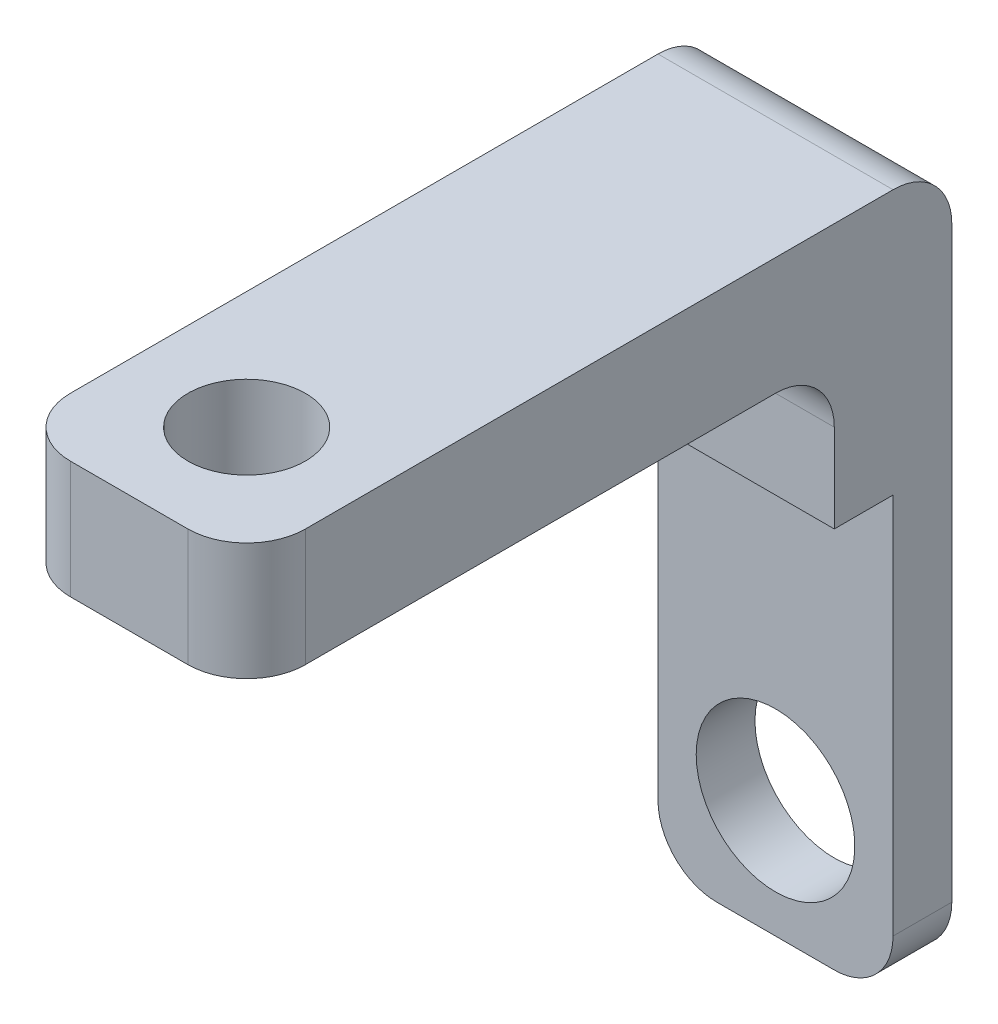
ISO-10303-21;
HEADER;
FILE_DESCRIPTION(('STEP AP214'),'2;1');
FILE_NAME('part.step','',(''),(''),'','','');
FILE_SCHEMA(('AUTOMOTIVE_DESIGN { 1 0 10303 214 1 1 1 1 }'));
ENDSEC;
DATA;
#1=APPLICATION_CONTEXT('core data for automotive mechanical design processes');
#2=APPLICATION_PROTOCOL_DEFINITION('international standard','automotive_design',2000,#1);
#3=PRODUCT_CONTEXT('',#1,'mechanical');
#4=PRODUCT('Part','Part','',(#3));
#5=PRODUCT_RELATED_PRODUCT_CATEGORY('part','',(#4));
#6=PRODUCT_DEFINITION_FORMATION('','',#4);
#7=PRODUCT_DEFINITION_CONTEXT('part definition',#1,'design');
#8=PRODUCT_DEFINITION('design','',#6,#7);
#9=PRODUCT_DEFINITION_SHAPE('','',#8);
#10=(LENGTH_UNIT() NAMED_UNIT(*) SI_UNIT(.MILLI.,.METRE.));
#11=(NAMED_UNIT(*) PLANE_ANGLE_UNIT() SI_UNIT($,.RADIAN.));
#12=(NAMED_UNIT(*) SI_UNIT($,.STERADIAN.) SOLID_ANGLE_UNIT());
#13=UNCERTAINTY_MEASURE_WITH_UNIT(LENGTH_MEASURE(1.E-05),#10,'distance_accuracy_value','');
#14=(GEOMETRIC_REPRESENTATION_CONTEXT(3) GLOBAL_UNCERTAINTY_ASSIGNED_CONTEXT((#13)) GLOBAL_UNIT_ASSIGNED_CONTEXT((#10,
#11,#12)) REPRESENTATION_CONTEXT('',''));
#15=CARTESIAN_POINT('',(0.,0.,0.));
#16=DIRECTION('',(0.,0.,1.));
#17=DIRECTION('',(1.,0.,0.));
#18=AXIS2_PLACEMENT_3D('',#15,#16,#17);
#19=CARTESIAN_POINT('',(0.,0.,0.));
#20=DIRECTION('',(0.,1.,0.));
#21=DIRECTION('',(0.,0.,1.));
#22=AXIS2_PLACEMENT_3D('',#19,#20,#21);
#23=PLANE('',#22);
#24=CARTESIAN_POINT('',(0.,0.,40.));
#25=DIRECTION('',(0.,1.,0.));
#26=DIRECTION('',(0.,0.,1.));
#27=AXIS2_PLACEMENT_3D('',#24,#25,#26);
#28=CIRCLE('',#27,10.);
#29=CARTESIAN_POINT('',(0.,0.,50.));
#30=VERTEX_POINT('',#29);
#31=EDGE_CURVE('E300',#30,#30,#28,.F.);
#32=ORIENTED_EDGE('',*,*,#31,.F.);
#33=EDGE_LOOP('',(#32));
#34=FACE_BOUND('',#33,.T.);
#35=DIRECTION('',(0.,0.,1.));
#36=VECTOR('',#35,1.);
#37=CARTESIAN_POINT('',(-20.,0.,-60.));
#38=LINE('',#37,#36);
#39=CARTESIAN_POINT('',(-20.,0.,-30.));
#40=VERTEX_POINT('',#39);
#41=CARTESIAN_POINT('',(-20.,0.,50.));
#42=VERTEX_POINT('',#41);
#43=EDGE_CURVE('E184',#40,#42,#38,.T.);
#44=ORIENTED_EDGE('',*,*,#43,.F.);
#45=DIRECTION('',(-1.,0.,0.));
#46=VECTOR('',#45,1.);
#47=CARTESIAN_POINT('',(20.,0.,-30.));
#48=LINE('',#47,#46);
#49=CARTESIAN_POINT('',(20.,0.,-30.));
#50=VERTEX_POINT('',#49);
#51=EDGE_CURVE('E53',#40,#50,#48,.F.);
#52=ORIENTED_EDGE('',*,*,#51,.T.);
#53=DIRECTION('',(0.,0.,-1.));
#54=VECTOR('',#53,1.);
#55=CARTESIAN_POINT('',(20.,0.,-60.));
#56=LINE('',#55,#54);
#57=CARTESIAN_POINT('',(20.,0.,50.));
#58=VERTEX_POINT('',#57);
#59=EDGE_CURVE('E181',#58,#50,#56,.T.);
#60=ORIENTED_EDGE('',*,*,#59,.F.);
#61=CARTESIAN_POINT('',(10.,0.,50.));
#62=DIRECTION('',(0.,1.,0.));
#63=DIRECTION('',(0.,0.,1.));
#64=AXIS2_PLACEMENT_3D('',#61,#62,#63);
#65=CIRCLE('',#64,10.);
#66=CARTESIAN_POINT('',(10.,0.,60.));
#67=VERTEX_POINT('',#66);
#68=EDGE_CURVE('E198',#58,#67,#65,.F.);
#69=ORIENTED_EDGE('',*,*,#68,.T.);
#70=DIRECTION('',(1.,0.,0.));
#71=VECTOR('',#70,1.);
#72=CARTESIAN_POINT('',(-20.,0.,60.));
#73=LINE('',#72,#71);
#74=CARTESIAN_POINT('',(-10.,0.,60.));
#75=VERTEX_POINT('',#74);
#76=EDGE_CURVE('E169',#75,#67,#73,.T.);
#77=ORIENTED_EDGE('',*,*,#76,.F.);
#78=CARTESIAN_POINT('',(-10.,0.,50.));
#79=DIRECTION('',(0.,1.,0.));
#80=DIRECTION('',(0.,0.,1.));
#81=AXIS2_PLACEMENT_3D('',#78,#79,#80);
#82=CIRCLE('',#81,10.);
#83=EDGE_CURVE('E195',#75,#42,#82,.F.);
#84=ORIENTED_EDGE('',*,*,#83,.T.);
#85=EDGE_LOOP('',(#44,#52,#60,#69,#77,#84));
#86=FACE_BOUND('',#85,.T.);
#87=ADVANCED_FACE('F32',(#34,#86),#23,.F.);
#88=CARTESIAN_POINT('',(20.,20.,-60.));
#89=DIRECTION('',(-1.,0.,0.));
#90=DIRECTION('',(0.,0.,1.));
#91=AXIS2_PLACEMENT_3D('',#88,#89,#90);
#92=PLANE('',#91);
#93=DIRECTION('',(0.,0.,-1.));
#94=VECTOR('',#93,1.);
#95=CARTESIAN_POINT('',(20.,20.,-60.));
#96=LINE('',#95,#94);
#97=CARTESIAN_POINT('',(20.,20.,50.));
#98=VERTEX_POINT('',#97);
#99=CARTESIAN_POINT('',(20.,20.,-50.));
#100=VERTEX_POINT('',#99);
#101=EDGE_CURVE('E165',#98,#100,#96,.T.);
#102=ORIENTED_EDGE('',*,*,#101,.F.);
#103=DIRECTION('',(0.,-1.,0.));
#104=VECTOR('',#103,1.);
#105=CARTESIAN_POINT('',(20.,20.,50.));
#106=LINE('',#105,#104);
#107=EDGE_CURVE('E192',#98,#58,#106,.T.);
#108=ORIENTED_EDGE('',*,*,#107,.T.);
#109=ORIENTED_EDGE('',*,*,#59,.T.);
#110=CARTESIAN_POINT('',(20.,-9.99999999999999,-30.));
#111=DIRECTION('',(-1.,0.,0.));
#112=DIRECTION('',(0.,0.,1.));
#113=AXIS2_PLACEMENT_3D('',#110,#111,#112);
#114=CIRCLE('',#113,10.);
#115=CARTESIAN_POINT('',(20.,-10.,-40.));
#116=VERTEX_POINT('',#115);
#117=EDGE_CURVE('E11',#50,#116,#114,.T.);
#118=ORIENTED_EDGE('',*,*,#117,.T.);
#119=DIRECTION('',(0.,1.,0.));
#120=VECTOR('',#119,1.);
#121=CARTESIAN_POINT('',(20.,-100.,-40.));
#122=LINE('',#121,#120);
#123=CARTESIAN_POINT('',(20.,-25.,-40.));
#124=VERTEX_POINT('',#123);
#125=EDGE_CURVE('E156',#124,#116,#122,.T.);
#126=ORIENTED_EDGE('',*,*,#125,.F.);
#127=DIRECTION('',(0.,0.,1.));
#128=VECTOR('',#127,1.);
#129=CARTESIAN_POINT('',(20.,-25.,-50.));
#130=LINE('',#129,#128);
#131=CARTESIAN_POINT('',(20.,-25.,-50.));
#132=VERTEX_POINT('',#131);
#133=EDGE_CURVE('E147',#132,#124,#130,.T.);
#134=ORIENTED_EDGE('',*,*,#133,.F.);
#135=DIRECTION('',(0.,1.,0.));
#136=VECTOR('',#135,1.);
#137=CARTESIAN_POINT('',(20.,-100.,-50.));
#138=LINE('',#137,#136);
#139=CARTESIAN_POINT('',(20.,-90.,-50.));
#140=VERTEX_POINT('',#139);
#141=EDGE_CURVE('E132',#140,#132,#138,.T.);
#142=ORIENTED_EDGE('',*,*,#141,.F.);
#143=DIRECTION('',(0.,0.,1.));
#144=VECTOR('',#143,1.);
#145=CARTESIAN_POINT('',(20.,-90.,-60.));
#146=LINE('',#145,#144);
#147=CARTESIAN_POINT('',(20.,-90.,-60.));
#148=VERTEX_POINT('',#147);
#149=EDGE_CURVE('E189',#140,#148,#146,.F.);
#150=ORIENTED_EDGE('',*,*,#149,.T.);
#151=DIRECTION('',(0.,-1.,0.));
#152=VECTOR('',#151,1.);
#153=CARTESIAN_POINT('',(20.,20.,-60.));
#154=LINE('',#153,#152);
#155=CARTESIAN_POINT('',(20.,10.,-60.));
#156=VERTEX_POINT('',#155);
#157=EDGE_CURVE('E190',#156,#148,#154,.T.);
#158=ORIENTED_EDGE('',*,*,#157,.F.);
#159=CARTESIAN_POINT('',(20.,10.,-50.));
#160=DIRECTION('',(-1.,0.,0.));
#161=DIRECTION('',(0.,0.,1.));
#162=AXIS2_PLACEMENT_3D('',#159,#160,#161);
#163=CIRCLE('',#162,10.);
#164=EDGE_CURVE('E187',#156,#100,#163,.F.);
#165=ORIENTED_EDGE('',*,*,#164,.T.);
#166=EDGE_LOOP('',(#102,#108,#109,#118,#126,#134,#142,#150,#158,#165));
#167=FACE_BOUND('',#166,.T.);
#168=ADVANCED_FACE('F154',(#167),#92,.F.);
#169=CARTESIAN_POINT('',(-20.,20.,-60.));
#170=DIRECTION('',(0.,0.,1.));
#171=DIRECTION('',(1.,0.,0.));
#172=AXIS2_PLACEMENT_3D('',#169,#170,#171);
#173=PLANE('',#172);
#174=CARTESIAN_POINT('',(0.,-80.,-60.));
#175=DIRECTION('',(0.,0.,-1.));
#176=DIRECTION('',(-1.,0.,0.));
#177=AXIS2_PLACEMENT_3D('',#174,#175,#176);
#178=CIRCLE('',#177,13.5);
#179=CARTESIAN_POINT('',(-13.5,-80.,-60.));
#180=VERTEX_POINT('',#179);
#181=EDGE_CURVE('E296',#180,#180,#178,.T.);
#182=ORIENTED_EDGE('',*,*,#181,.F.);
#183=EDGE_LOOP('',(#182));
#184=FACE_BOUND('',#183,.T.);
#185=ORIENTED_EDGE('',*,*,#157,.T.);
#186=CARTESIAN_POINT('',(9.99999999999999,-90.,-60.));
#187=DIRECTION('',(0.,0.,1.));
#188=DIRECTION('',(1.,0.,0.));
#189=AXIS2_PLACEMENT_3D('',#186,#187,#188);
#190=CIRCLE('',#189,10.);
#191=CARTESIAN_POINT('',(9.99999999999998,-100.,-60.));
#192=VERTEX_POINT('',#191);
#193=EDGE_CURVE('E231',#148,#192,#190,.F.);
#194=ORIENTED_EDGE('',*,*,#193,.T.);
#195=DIRECTION('',(1.,0.,0.));
#196=VECTOR('',#195,1.);
#197=CARTESIAN_POINT('',(-20.,-100.,-60.));
#198=LINE('',#197,#196);
#199=CARTESIAN_POINT('',(-10.,-100.,-60.));
#200=VERTEX_POINT('',#199);
#201=EDGE_CURVE('E158',#200,#192,#198,.T.);
#202=ORIENTED_EDGE('',*,*,#201,.F.);
#203=CARTESIAN_POINT('',(-10.,-90.,-60.));
#204=DIRECTION('',(0.,0.,1.));
#205=DIRECTION('',(1.,0.,0.));
#206=AXIS2_PLACEMENT_3D('',#203,#204,#205);
#207=CIRCLE('',#206,10.);
#208=CARTESIAN_POINT('',(-20.,-90.,-60.));
#209=VERTEX_POINT('',#208);
#210=EDGE_CURVE('E229',#200,#209,#207,.F.);
#211=ORIENTED_EDGE('',*,*,#210,.T.);
#212=DIRECTION('',(0.,-1.,0.));
#213=VECTOR('',#212,1.);
#214=CARTESIAN_POINT('',(-20.,20.,-60.));
#215=LINE('',#214,#213);
#216=CARTESIAN_POINT('',(-20.,10.,-60.));
#217=VERTEX_POINT('',#216);
#218=EDGE_CURVE('E175',#217,#209,#215,.T.);
#219=ORIENTED_EDGE('',*,*,#218,.F.);
#220=DIRECTION('',(-1.,0.,0.));
#221=VECTOR('',#220,1.);
#222=CARTESIAN_POINT('',(20.,10.,-60.));
#223=LINE('',#222,#221);
#224=EDGE_CURVE('E227',#217,#156,#223,.F.);
#225=ORIENTED_EDGE('',*,*,#224,.T.);
#226=EDGE_LOOP('',(#185,#194,#202,#211,#219,#225));
#227=FACE_BOUND('',#226,.T.);
#228=ADVANCED_FACE('F276',(#184,#227),#173,.F.);
#229=CARTESIAN_POINT('',(-20.,20.,-60.));
#230=DIRECTION('',(1.,0.,0.));
#231=DIRECTION('',(0.,0.,-1.));
#232=AXIS2_PLACEMENT_3D('',#229,#230,#231);
#233=PLANE('',#232);
#234=DIRECTION('',(0.,1.,0.));
#235=VECTOR('',#234,1.);
#236=CARTESIAN_POINT('',(-20.,-100.,-40.));
#237=LINE('',#236,#235);
#238=CARTESIAN_POINT('',(-20.,-25.,-40.));
#239=VERTEX_POINT('',#238);
#240=CARTESIAN_POINT('',(-20.,-10.,-40.));
#241=VERTEX_POINT('',#240);
#242=EDGE_CURVE('E164',#239,#241,#237,.T.);
#243=ORIENTED_EDGE('',*,*,#242,.T.);
#244=CARTESIAN_POINT('',(-20.,-9.99999999999999,-30.));
#245=DIRECTION('',(1.,0.,0.));
#246=DIRECTION('',(0.,0.,-1.));
#247=AXIS2_PLACEMENT_3D('',#244,#245,#246);
#248=CIRCLE('',#247,10.);
#249=EDGE_CURVE('E40',#241,#40,#248,.T.);
#250=ORIENTED_EDGE('',*,*,#249,.T.);
#251=ORIENTED_EDGE('',*,*,#43,.T.);
#252=DIRECTION('',(0.,-1.,0.));
#253=VECTOR('',#252,1.);
#254=CARTESIAN_POINT('',(-20.,20.,50.));
#255=LINE('',#254,#253);
#256=CARTESIAN_POINT('',(-20.,20.,50.));
#257=VERTEX_POINT('',#256);
#258=EDGE_CURVE('E216',#42,#257,#255,.F.);
#259=ORIENTED_EDGE('',*,*,#258,.T.);
#260=DIRECTION('',(0.,0.,1.));
#261=VECTOR('',#260,1.);
#262=CARTESIAN_POINT('',(-20.,20.,-60.));
#263=LINE('',#262,#261);
#264=CARTESIAN_POINT('',(-20.,20.,-50.));
#265=VERTEX_POINT('',#264);
#266=EDGE_CURVE('E168',#265,#257,#263,.T.);
#267=ORIENTED_EDGE('',*,*,#266,.F.);
#268=CARTESIAN_POINT('',(-20.,10.,-50.));
#269=DIRECTION('',(1.,0.,0.));
#270=DIRECTION('',(0.,0.,-1.));
#271=AXIS2_PLACEMENT_3D('',#268,#269,#270);
#272=CIRCLE('',#271,10.);
#273=EDGE_CURVE('E212',#265,#217,#272,.F.);
#274=ORIENTED_EDGE('',*,*,#273,.T.);
#275=ORIENTED_EDGE('',*,*,#218,.T.);
#276=DIRECTION('',(0.,0.,-1.));
#277=VECTOR('',#276,1.);
#278=CARTESIAN_POINT('',(-20.,-90.,-60.));
#279=LINE('',#278,#277);
#280=CARTESIAN_POINT('',(-20.,-90.,-50.));
#281=VERTEX_POINT('',#280);
#282=EDGE_CURVE('E214',#209,#281,#279,.F.);
#283=ORIENTED_EDGE('',*,*,#282,.T.);
#284=DIRECTION('',(0.,-1.,0.));
#285=VECTOR('',#284,1.);
#286=CARTESIAN_POINT('',(-20.,-100.,-50.));
#287=LINE('',#286,#285);
#288=CARTESIAN_POINT('',(-20.,-25.,-50.));
#289=VERTEX_POINT('',#288);
#290=EDGE_CURVE('E290',#289,#281,#287,.T.);
#291=ORIENTED_EDGE('',*,*,#290,.F.);
#292=DIRECTION('',(0.,0.,1.));
#293=VECTOR('',#292,1.);
#294=CARTESIAN_POINT('',(-20.,-25.,-50.));
#295=LINE('',#294,#293);
#296=EDGE_CURVE('E150',#289,#239,#295,.T.);
#297=ORIENTED_EDGE('',*,*,#296,.T.);
#298=EDGE_LOOP('',(#243,#250,#251,#259,#267,#274,#275,#283,#291,#297));
#299=FACE_BOUND('',#298,.T.);
#300=ADVANCED_FACE('F269',(#299),#233,.F.);
#301=CARTESIAN_POINT('',(-20.,20.,60.));
#302=DIRECTION('',(0.,0.,-1.));
#303=DIRECTION('',(-1.,0.,0.));
#304=AXIS2_PLACEMENT_3D('',#301,#302,#303);
#305=PLANE('',#304);
#306=ORIENTED_EDGE('',*,*,#76,.T.);
#307=DIRECTION('',(0.,-1.,0.));
#308=VECTOR('',#307,1.);
#309=CARTESIAN_POINT('',(10.,20.,60.));
#310=LINE('',#309,#308);
#311=CARTESIAN_POINT('',(10.,20.,60.));
#312=VERTEX_POINT('',#311);
#313=EDGE_CURVE('E203',#67,#312,#310,.F.);
#314=ORIENTED_EDGE('',*,*,#313,.T.);
#315=DIRECTION('',(1.,0.,0.));
#316=VECTOR('',#315,1.);
#317=CARTESIAN_POINT('',(-20.,20.,60.));
#318=LINE('',#317,#316);
#319=CARTESIAN_POINT('',(-10.,20.,60.));
#320=VERTEX_POINT('',#319);
#321=EDGE_CURVE('E172',#320,#312,#318,.T.);
#322=ORIENTED_EDGE('',*,*,#321,.F.);
#323=DIRECTION('',(0.,-1.,0.));
#324=VECTOR('',#323,1.);
#325=CARTESIAN_POINT('',(-10.,20.,60.));
#326=LINE('',#325,#324);
#327=EDGE_CURVE('E200',#320,#75,#326,.T.);
#328=ORIENTED_EDGE('',*,*,#327,.T.);
#329=EDGE_LOOP('',(#306,#314,#322,#328));
#330=FACE_BOUND('',#329,.T.);
#331=ADVANCED_FACE('F260',(#330),#305,.F.);
#332=CARTESIAN_POINT('',(0.,20.,0.));
#333=DIRECTION('',(0.,1.,0.));
#334=DIRECTION('',(0.,0.,1.));
#335=AXIS2_PLACEMENT_3D('',#332,#333,#334);
#336=PLANE('',#335);
#337=CARTESIAN_POINT('',(0.,20.,40.));
#338=DIRECTION('',(0.,1.,0.));
#339=DIRECTION('',(0.,0.,1.));
#340=AXIS2_PLACEMENT_3D('',#337,#338,#339);
#341=CIRCLE('',#340,10.);
#342=CARTESIAN_POINT('',(0.,20.,50.));
#343=VERTEX_POINT('',#342);
#344=EDGE_CURVE('E305',#343,#343,#341,.T.);
#345=ORIENTED_EDGE('',*,*,#344,.F.);
#346=EDGE_LOOP('',(#345));
#347=FACE_BOUND('',#346,.T.);
#348=ORIENTED_EDGE('',*,*,#321,.T.);
#349=CARTESIAN_POINT('',(10.,20.,50.));
#350=DIRECTION('',(0.,1.,0.));
#351=DIRECTION('',(0.,0.,1.));
#352=AXIS2_PLACEMENT_3D('',#349,#350,#351);
#353=CIRCLE('',#352,10.);
#354=EDGE_CURVE('E210',#312,#98,#353,.T.);
#355=ORIENTED_EDGE('',*,*,#354,.T.);
#356=ORIENTED_EDGE('',*,*,#101,.T.);
#357=DIRECTION('',(-1.,0.,0.));
#358=VECTOR('',#357,1.);
#359=CARTESIAN_POINT('',(-20.,20.,-50.));
#360=LINE('',#359,#358);
#361=EDGE_CURVE('E205',#100,#265,#360,.T.);
#362=ORIENTED_EDGE('',*,*,#361,.T.);
#363=ORIENTED_EDGE('',*,*,#266,.T.);
#364=CARTESIAN_POINT('',(-10.,20.,50.));
#365=DIRECTION('',(0.,1.,0.));
#366=DIRECTION('',(0.,0.,1.));
#367=AXIS2_PLACEMENT_3D('',#364,#365,#366);
#368=CIRCLE('',#367,10.);
#369=EDGE_CURVE('E208',#257,#320,#368,.T.);
#370=ORIENTED_EDGE('',*,*,#369,.T.);
#371=EDGE_LOOP('',(#348,#355,#356,#362,#363,#370));
#372=FACE_BOUND('',#371,.T.);
#373=ADVANCED_FACE('F263',(#347,#372),#336,.T.);
#374=CARTESIAN_POINT('',(-20.,-100.,-40.));
#375=DIRECTION('',(0.,0.,-1.));
#376=DIRECTION('',(-1.,0.,0.));
#377=AXIS2_PLACEMENT_3D('',#374,#375,#376);
#378=PLANE('',#377);
#379=ORIENTED_EDGE('',*,*,#125,.T.);
#380=DIRECTION('',(-1.,0.,0.));
#381=VECTOR('',#380,1.);
#382=CARTESIAN_POINT('',(-20.,-9.99999999999999,-40.));
#383=LINE('',#382,#381);
#384=EDGE_CURVE('E233',#116,#241,#383,.T.);
#385=ORIENTED_EDGE('',*,*,#384,.T.);
#386=ORIENTED_EDGE('',*,*,#242,.F.);
#387=DIRECTION('',(-1.,0.,0.));
#388=VECTOR('',#387,1.);
#389=CARTESIAN_POINT('',(-20.,-25.,-40.));
#390=LINE('',#389,#388);
#391=EDGE_CURVE('E252',#124,#239,#390,.T.);
#392=ORIENTED_EDGE('',*,*,#391,.F.);
#393=EDGE_LOOP('',(#379,#385,#386,#392));
#394=FACE_BOUND('',#393,.T.);
#395=ADVANCED_FACE('F251',(#394),#378,.F.);
#396=CARTESIAN_POINT('',(0.,-100.,0.));
#397=DIRECTION('',(0.,1.,0.));
#398=DIRECTION('',(0.,0.,1.));
#399=AXIS2_PLACEMENT_3D('',#396,#397,#398);
#400=PLANE('',#399);
#401=ORIENTED_EDGE('',*,*,#201,.T.);
#402=DIRECTION('',(0.,0.,1.));
#403=VECTOR('',#402,1.);
#404=CARTESIAN_POINT('',(9.99999999999999,-100.,0.));
#405=LINE('',#404,#403);
#406=CARTESIAN_POINT('',(9.99999999999999,-100.,-50.));
#407=VERTEX_POINT('',#406);
#408=EDGE_CURVE('E221',#192,#407,#405,.T.);
#409=ORIENTED_EDGE('',*,*,#408,.T.);
#410=DIRECTION('',(1.,0.,0.));
#411=VECTOR('',#410,1.);
#412=CARTESIAN_POINT('',(-20.,-100.,-50.));
#413=LINE('',#412,#411);
#414=CARTESIAN_POINT('',(-10.,-100.,-50.));
#415=VERTEX_POINT('',#414);
#416=EDGE_CURVE('E143',#415,#407,#413,.T.);
#417=ORIENTED_EDGE('',*,*,#416,.F.);
#418=DIRECTION('',(0.,0.,-1.));
#419=VECTOR('',#418,1.);
#420=CARTESIAN_POINT('',(-10.,-100.,0.));
#421=LINE('',#420,#419);
#422=EDGE_CURVE('E218',#415,#200,#421,.T.);
#423=ORIENTED_EDGE('',*,*,#422,.T.);
#424=EDGE_LOOP('',(#401,#409,#417,#423));
#425=FACE_BOUND('',#424,.T.);
#426=ADVANCED_FACE('F287',(#425),#400,.F.);
#427=CARTESIAN_POINT('',(-20.,-25.,-50.));
#428=DIRECTION('',(0.,1.,0.));
#429=DIRECTION('',(0.,0.,1.));
#430=AXIS2_PLACEMENT_3D('',#427,#428,#429);
#431=PLANE('',#430);
#432=ORIENTED_EDGE('',*,*,#391,.T.);
#433=ORIENTED_EDGE('',*,*,#296,.F.);
#434=DIRECTION('',(-1.,0.,0.));
#435=VECTOR('',#434,1.);
#436=CARTESIAN_POINT('',(-20.,-25.,-50.));
#437=LINE('',#436,#435);
#438=EDGE_CURVE('E137',#132,#289,#437,.T.);
#439=ORIENTED_EDGE('',*,*,#438,.F.);
#440=ORIENTED_EDGE('',*,*,#133,.T.);
#441=EDGE_LOOP('',(#432,#433,#439,#440));
#442=FACE_BOUND('',#441,.T.);
#443=ADVANCED_FACE('F146',(#442),#431,.F.);
#444=CARTESIAN_POINT('',(0.,0.,-50.));
#445=DIRECTION('',(0.,0.,-1.));
#446=DIRECTION('',(-1.,0.,0.));
#447=AXIS2_PLACEMENT_3D('',#444,#445,#446);
#448=PLANE('',#447);
#449=CARTESIAN_POINT('',(0.,-80.,-50.));
#450=DIRECTION('',(0.,0.,-1.));
#451=DIRECTION('',(-1.,0.,0.));
#452=AXIS2_PLACEMENT_3D('',#449,#450,#451);
#453=CIRCLE('',#452,13.5);
#454=CARTESIAN_POINT('',(-13.5,-80.,-50.));
#455=VERTEX_POINT('',#454);
#456=EDGE_CURVE('E294',#455,#455,#453,.F.);
#457=ORIENTED_EDGE('',*,*,#456,.F.);
#458=EDGE_LOOP('',(#457));
#459=FACE_BOUND('',#458,.T.);
#460=ORIENTED_EDGE('',*,*,#416,.T.);
#461=CARTESIAN_POINT('',(9.99999999999999,-90.,-50.));
#462=DIRECTION('',(0.,0.,-1.));
#463=DIRECTION('',(-1.,0.,0.));
#464=AXIS2_PLACEMENT_3D('',#461,#462,#463);
#465=CIRCLE('',#464,10.);
#466=EDGE_CURVE('E139',#407,#140,#465,.F.);
#467=ORIENTED_EDGE('',*,*,#466,.T.);
#468=ORIENTED_EDGE('',*,*,#141,.T.);
#469=ORIENTED_EDGE('',*,*,#438,.T.);
#470=ORIENTED_EDGE('',*,*,#290,.T.);
#471=CARTESIAN_POINT('',(-10.,-90.,-50.));
#472=DIRECTION('',(0.,0.,-1.));
#473=DIRECTION('',(-1.,0.,0.));
#474=AXIS2_PLACEMENT_3D('',#471,#472,#473);
#475=CIRCLE('',#474,10.);
#476=EDGE_CURVE('E224',#281,#415,#475,.F.);
#477=ORIENTED_EDGE('',*,*,#476,.T.);
#478=EDGE_LOOP('',(#460,#467,#468,#469,#470,#477));
#479=FACE_BOUND('',#478,.T.);
#480=ADVANCED_FACE('F135',(#459,#479),#448,.F.);
#481=CARTESIAN_POINT('',(10.,20.,50.));
#482=DIRECTION('',(0.,-1.,0.));
#483=DIRECTION('',(0.,0.,-1.));
#484=AXIS2_PLACEMENT_3D('',#481,#482,#483);
#485=CYLINDRICAL_SURFACE('',#484,10.);
#486=ORIENTED_EDGE('',*,*,#354,.F.);
#487=ORIENTED_EDGE('',*,*,#313,.F.);
#488=ORIENTED_EDGE('',*,*,#68,.F.);
#489=ORIENTED_EDGE('',*,*,#107,.F.);
#490=EDGE_LOOP('',(#486,#487,#488,#489));
#491=FACE_BOUND('',#490,.T.);
#492=ADVANCED_FACE('F258',(#491),#485,.T.);
#493=CARTESIAN_POINT('',(-10.,20.,50.));
#494=DIRECTION('',(0.,-1.,0.));
#495=DIRECTION('',(0.,0.,-1.));
#496=AXIS2_PLACEMENT_3D('',#493,#494,#495);
#497=CYLINDRICAL_SURFACE('',#496,10.);
#498=ORIENTED_EDGE('',*,*,#369,.F.);
#499=ORIENTED_EDGE('',*,*,#258,.F.);
#500=ORIENTED_EDGE('',*,*,#83,.F.);
#501=ORIENTED_EDGE('',*,*,#327,.F.);
#502=EDGE_LOOP('',(#498,#499,#500,#501));
#503=FACE_BOUND('',#502,.T.);
#504=ADVANCED_FACE('F268',(#503),#497,.T.);
#505=CARTESIAN_POINT('',(9.99999999999999,-90.,0.));
#506=DIRECTION('',(0.,0.,1.));
#507=DIRECTION('',(1.,0.,0.));
#508=AXIS2_PLACEMENT_3D('',#505,#506,#507);
#509=CYLINDRICAL_SURFACE('',#508,10.);
#510=ORIENTED_EDGE('',*,*,#193,.F.);
#511=ORIENTED_EDGE('',*,*,#149,.F.);
#512=ORIENTED_EDGE('',*,*,#466,.F.);
#513=ORIENTED_EDGE('',*,*,#408,.F.);
#514=EDGE_LOOP('',(#510,#511,#512,#513));
#515=FACE_BOUND('',#514,.T.);
#516=ADVANCED_FACE('F284',(#515),#509,.T.);
#517=CARTESIAN_POINT('',(-10.,-90.,0.));
#518=DIRECTION('',(0.,0.,-1.));
#519=DIRECTION('',(-1.,0.,0.));
#520=AXIS2_PLACEMENT_3D('',#517,#518,#519);
#521=CYLINDRICAL_SURFACE('',#520,10.);
#522=ORIENTED_EDGE('',*,*,#476,.F.);
#523=ORIENTED_EDGE('',*,*,#282,.F.);
#524=ORIENTED_EDGE('',*,*,#210,.F.);
#525=ORIENTED_EDGE('',*,*,#422,.F.);
#526=EDGE_LOOP('',(#522,#523,#524,#525));
#527=FACE_BOUND('',#526,.T.);
#528=ADVANCED_FACE('F340',(#527),#521,.T.);
#529=CARTESIAN_POINT('',(0.,10.,-50.));
#530=DIRECTION('',(1.,0.,0.));
#531=DIRECTION('',(0.,0.,-1.));
#532=AXIS2_PLACEMENT_3D('',#529,#530,#531);
#533=CYLINDRICAL_SURFACE('',#532,10.);
#534=ORIENTED_EDGE('',*,*,#164,.F.);
#535=ORIENTED_EDGE('',*,*,#224,.F.);
#536=ORIENTED_EDGE('',*,*,#273,.F.);
#537=ORIENTED_EDGE('',*,*,#361,.F.);
#538=EDGE_LOOP('',(#534,#535,#536,#537));
#539=FACE_BOUND('',#538,.T.);
#540=ADVANCED_FACE('F280',(#539),#533,.T.);
#541=CARTESIAN_POINT('',(0.,-80.,60.001));
#542=DIRECTION('',(0.,0.,-1.));
#543=DIRECTION('',(-1.,0.,0.));
#544=AXIS2_PLACEMENT_3D('',#541,#542,#543);
#545=CYLINDRICAL_SURFACE('',#544,13.5);
#546=ORIENTED_EDGE('',*,*,#181,.T.);
#547=EDGE_LOOP('',(#546));
#548=FACE_BOUND('',#547,.T.);
#549=ORIENTED_EDGE('',*,*,#456,.T.);
#550=EDGE_LOOP('',(#549));
#551=FACE_BOUND('',#550,.T.);
#552=ADVANCED_FACE('F344',(#548,#551),#545,.F.);
#553=CARTESIAN_POINT('',(0.,-100.001,40.));
#554=DIRECTION('',(0.,1.,0.));
#555=DIRECTION('',(0.,0.,1.));
#556=AXIS2_PLACEMENT_3D('',#553,#554,#555);
#557=CYLINDRICAL_SURFACE('',#556,10.);
#558=ORIENTED_EDGE('',*,*,#344,.T.);
#559=EDGE_LOOP('',(#558));
#560=FACE_BOUND('',#559,.T.);
#561=ORIENTED_EDGE('',*,*,#31,.T.);
#562=EDGE_LOOP('',(#561));
#563=FACE_BOUND('',#562,.T.);
#564=ADVANCED_FACE('F309',(#560,#563),#557,.F.);
#565=CARTESIAN_POINT('',(-20.,-9.99999999999999,-30.));
#566=DIRECTION('',(1.,0.,0.));
#567=DIRECTION('',(0.,0.,-1.));
#568=AXIS2_PLACEMENT_3D('',#565,#566,#567);
#569=CYLINDRICAL_SURFACE('',#568,10.);
#570=ORIENTED_EDGE('',*,*,#117,.F.);
#571=ORIENTED_EDGE('',*,*,#51,.F.);
#572=ORIENTED_EDGE('',*,*,#249,.F.);
#573=ORIENTED_EDGE('',*,*,#384,.F.);
#574=EDGE_LOOP('',(#570,#571,#572,#573));
#575=FACE_BOUND('',#574,.T.);
#576=ADVANCED_FACE('F34',(#575),#569,.F.);
#577=CLOSED_SHELL('',(#87,#168,#228,#300,#331,#373,#395,#426,#443,#480,#492,#504,#516,#528,#540,
#552,#564,#576));
#578=MANIFOLD_SOLID_BREP('B2',#577);
#579=ADVANCED_BREP_SHAPE_REPRESENTATION('',(#18,#578),#14);
#580=SHAPE_DEFINITION_REPRESENTATION(#9,#579);
ENDSEC;
END-ISO-10303-21;
